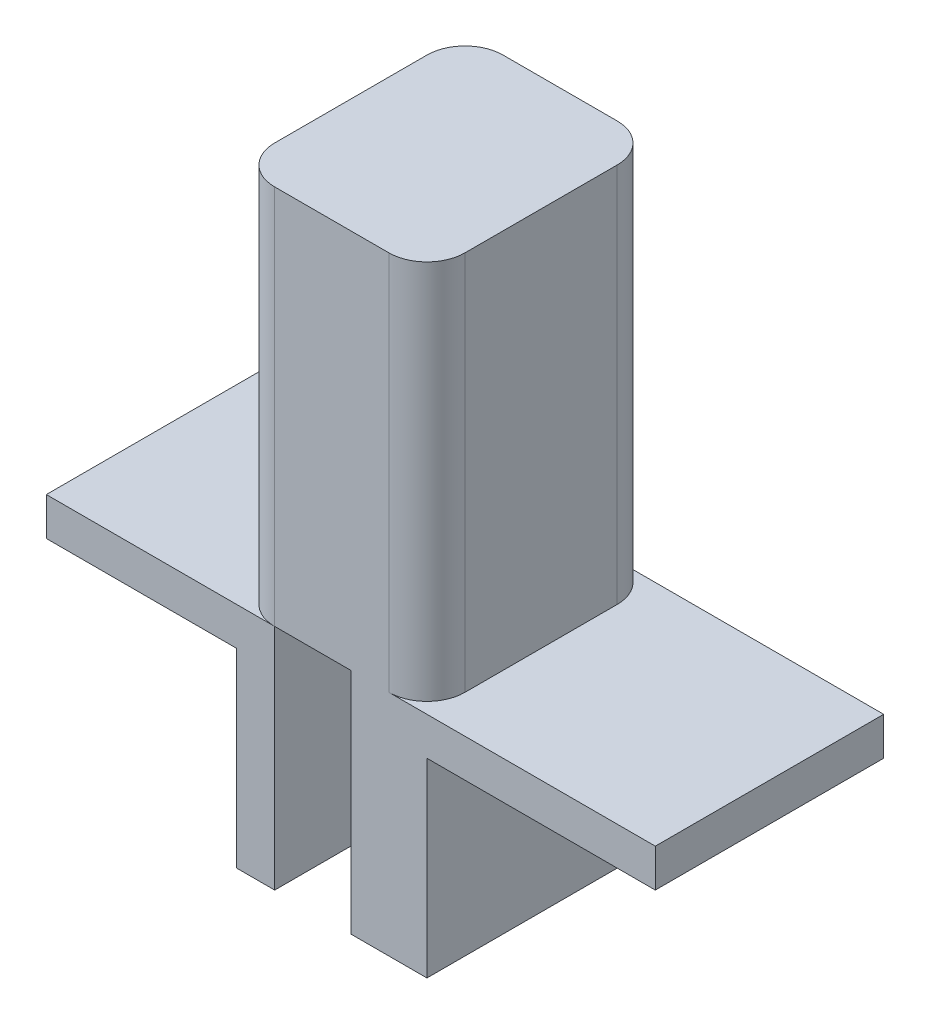
ISO-10303-21;
HEADER;
FILE_DESCRIPTION(('STEP AP214'),'2;1');
FILE_NAME('part.step','',(''),(''),'','','');
FILE_SCHEMA(('AUTOMOTIVE_DESIGN { 1 0 10303 214 1 1 1 1 }'));
ENDSEC;
DATA;
#1=APPLICATION_CONTEXT('core data for automotive mechanical design processes');
#2=APPLICATION_PROTOCOL_DEFINITION('international standard','automotive_design',2000,#1);
#3=PRODUCT_CONTEXT('',#1,'mechanical');
#4=PRODUCT('Part','Part','',(#3));
#5=PRODUCT_RELATED_PRODUCT_CATEGORY('part','',(#4));
#6=PRODUCT_DEFINITION_FORMATION('','',#4);
#7=PRODUCT_DEFINITION_CONTEXT('part definition',#1,'design');
#8=PRODUCT_DEFINITION('design','',#6,#7);
#9=PRODUCT_DEFINITION_SHAPE('','',#8);
#10=(LENGTH_UNIT() NAMED_UNIT(*) SI_UNIT(.MILLI.,.METRE.));
#11=(NAMED_UNIT(*) PLANE_ANGLE_UNIT() SI_UNIT($,.RADIAN.));
#12=(NAMED_UNIT(*) SI_UNIT($,.STERADIAN.) SOLID_ANGLE_UNIT());
#13=UNCERTAINTY_MEASURE_WITH_UNIT(LENGTH_MEASURE(1.E-05),#10,'distance_accuracy_value','');
#14=(GEOMETRIC_REPRESENTATION_CONTEXT(3) GLOBAL_UNCERTAINTY_ASSIGNED_CONTEXT((#13)) GLOBAL_UNIT_ASSIGNED_CONTEXT((#10,
#11,#12)) REPRESENTATION_CONTEXT('',''));
#15=CARTESIAN_POINT('',(0.,0.,0.));
#16=DIRECTION('',(0.,0.,1.));
#17=DIRECTION('',(1.,0.,0.));
#18=AXIS2_PLACEMENT_3D('',#15,#16,#17);
#19=CARTESIAN_POINT('',(-1.25,1.,1.5));
#20=DIRECTION('',(0.,0.,-1.));
#21=DIRECTION('',(-1.,0.,0.));
#22=AXIS2_PLACEMENT_3D('',#19,#20,#21);
#23=PLANE('',#22);
#24=DIRECTION('',(-1.,0.,0.));
#25=VECTOR('',#24,1.);
#26=CARTESIAN_POINT('',(4.25,0.,1.5));
#27=LINE('',#26,#25);
#28=CARTESIAN_POINT('',(4.25,0.,1.5));
#29=VERTEX_POINT('',#28);
#30=CARTESIAN_POINT('',(0.75,0.,1.5));
#31=VERTEX_POINT('',#30);
#32=EDGE_CURVE('E59',#29,#31,#27,.T.);
#33=ORIENTED_EDGE('',*,*,#32,.T.);
#34=DIRECTION('',(0.,-1.,0.));
#35=VECTOR('',#34,1.);
#36=CARTESIAN_POINT('',(0.75,1.,1.5));
#37=LINE('',#36,#35);
#38=CARTESIAN_POINT('',(0.75,5.,1.5));
#39=VERTEX_POINT('',#38);
#40=EDGE_CURVE('E349',#31,#39,#37,.F.);
#41=ORIENTED_EDGE('',*,*,#40,.T.);
#42=DIRECTION('',(1.,0.,0.));
#43=VECTOR('',#42,1.);
#44=CARTESIAN_POINT('',(-1.25,5.,1.5));
#45=LINE('',#44,#43);
#46=CARTESIAN_POINT('',(-0.75,5.,1.5));
#47=VERTEX_POINT('',#46);
#48=EDGE_CURVE('E367',#47,#39,#45,.T.);
#49=ORIENTED_EDGE('',*,*,#48,.F.);
#50=DIRECTION('',(0.,-1.,0.));
#51=VECTOR('',#50,1.);
#52=CARTESIAN_POINT('',(-0.75,1.,1.5));
#53=LINE('',#52,#51);
#54=CARTESIAN_POINT('',(-0.75,0.,1.5));
#55=VERTEX_POINT('',#54);
#56=EDGE_CURVE('E345',#47,#55,#53,.T.);
#57=ORIENTED_EDGE('',*,*,#56,.T.);
#58=DIRECTION('',(1.,0.,0.));
#59=VECTOR('',#58,1.);
#60=CARTESIAN_POINT('',(-1.25,0.,1.5));
#61=LINE('',#60,#59);
#62=CARTESIAN_POINT('',(0.25,0.,1.5));
#63=VERTEX_POINT('',#62);
#64=EDGE_CURVE('E299',#55,#63,#61,.T.);
#65=ORIENTED_EDGE('',*,*,#64,.T.);
#66=DIRECTION('',(0.,1.,0.));
#67=VECTOR('',#66,1.);
#68=CARTESIAN_POINT('',(0.25,-3.,1.5));
#69=LINE('',#68,#67);
#70=CARTESIAN_POINT('',(0.25,-3.,1.5));
#71=VERTEX_POINT('',#70);
#72=EDGE_CURVE('E291',#71,#63,#69,.T.);
#73=ORIENTED_EDGE('',*,*,#72,.F.);
#74=DIRECTION('',(-1.,0.,0.));
#75=VECTOR('',#74,1.);
#76=CARTESIAN_POINT('',(1.25,-3.,1.5));
#77=LINE('',#76,#75);
#78=CARTESIAN_POINT('',(1.25,-3.,1.5));
#79=VERTEX_POINT('',#78);
#80=EDGE_CURVE('E274',#79,#71,#77,.T.);
#81=ORIENTED_EDGE('',*,*,#80,.F.);
#82=DIRECTION('',(0.,-1.,0.));
#83=VECTOR('',#82,1.);
#84=CARTESIAN_POINT('',(1.25,1.,1.5));
#85=LINE('',#84,#83);
#86=CARTESIAN_POINT('',(1.25,-0.5,1.5));
#87=VERTEX_POINT('',#86);
#88=EDGE_CURVE('E302',#87,#79,#85,.T.);
#89=ORIENTED_EDGE('',*,*,#88,.F.);
#90=DIRECTION('',(-1.,0.,0.));
#91=VECTOR('',#90,1.);
#92=CARTESIAN_POINT('',(4.25,-0.5,1.5));
#93=LINE('',#92,#91);
#94=CARTESIAN_POINT('',(4.25,-0.5,1.5));
#95=VERTEX_POINT('',#94);
#96=EDGE_CURVE('E239',#95,#87,#93,.T.);
#97=ORIENTED_EDGE('',*,*,#96,.F.);
#98=DIRECTION('',(0.,-1.,0.));
#99=VECTOR('',#98,1.);
#100=CARTESIAN_POINT('',(4.25,0.,1.5));
#101=LINE('',#100,#99);
#102=EDGE_CURVE('E214',#29,#95,#101,.T.);
#103=ORIENTED_EDGE('',*,*,#102,.F.);
#104=EDGE_LOOP('',(#33,#41,#49,#57,#65,#73,#81,#89,#97,#103));
#105=FACE_BOUND('',#104,.T.);
#106=ADVANCED_FACE('F43',(#105),#23,.F.);
#107=CARTESIAN_POINT('',(-1.25,1.,-1.5));
#108=DIRECTION('',(0.,0.,1.));
#109=DIRECTION('',(1.,0.,0.));
#110=AXIS2_PLACEMENT_3D('',#107,#108,#109);
#111=PLANE('',#110);
#112=DIRECTION('',(1.,0.,0.));
#113=VECTOR('',#112,1.);
#114=CARTESIAN_POINT('',(-3.75,0.,-1.5));
#115=LINE('',#114,#113);
#116=CARTESIAN_POINT('',(-3.75,0.,-1.5));
#117=VERTEX_POINT('',#116);
#118=CARTESIAN_POINT('',(-0.75,0.,-1.5));
#119=VERTEX_POINT('',#118);
#120=EDGE_CURVE('E390',#117,#119,#115,.T.);
#121=ORIENTED_EDGE('',*,*,#120,.T.);
#122=DIRECTION('',(0.,1.,0.));
#123=VECTOR('',#122,1.);
#124=CARTESIAN_POINT('',(-0.75,-3.,-1.5));
#125=LINE('',#124,#123);
#126=CARTESIAN_POINT('',(-0.75,-3.,-1.5));
#127=VERTEX_POINT('',#126);
#128=EDGE_CURVE('E265',#127,#119,#125,.T.);
#129=ORIENTED_EDGE('',*,*,#128,.F.);
#130=DIRECTION('',(1.,0.,0.));
#131=VECTOR('',#130,1.);
#132=CARTESIAN_POINT('',(-1.25,-3.,-1.5));
#133=LINE('',#132,#131);
#134=CARTESIAN_POINT('',(-1.25,-3.,-1.5));
#135=VERTEX_POINT('',#134);
#136=EDGE_CURVE('E248',#135,#127,#133,.T.);
#137=ORIENTED_EDGE('',*,*,#136,.F.);
#138=DIRECTION('',(0.,-1.,0.));
#139=VECTOR('',#138,1.);
#140=CARTESIAN_POINT('',(-1.25,1.,-1.5));
#141=LINE('',#140,#139);
#142=CARTESIAN_POINT('',(-1.25,-0.5,-1.5));
#143=VERTEX_POINT('',#142);
#144=EDGE_CURVE('E201',#143,#135,#141,.T.);
#145=ORIENTED_EDGE('',*,*,#144,.F.);
#146=DIRECTION('',(1.,0.,0.));
#147=VECTOR('',#146,1.);
#148=CARTESIAN_POINT('',(-3.75,-0.5,-1.5));
#149=LINE('',#148,#147);
#150=CARTESIAN_POINT('',(-3.75,-0.5,-1.5));
#151=VERTEX_POINT('',#150);
#152=EDGE_CURVE('E180',#151,#143,#149,.T.);
#153=ORIENTED_EDGE('',*,*,#152,.F.);
#154=DIRECTION('',(0.,-1.,0.));
#155=VECTOR('',#154,1.);
#156=CARTESIAN_POINT('',(-3.75,0.,-1.5));
#157=LINE('',#156,#155);
#158=EDGE_CURVE('E187',#117,#151,#157,.T.);
#159=ORIENTED_EDGE('',*,*,#158,.F.);
#160=EDGE_LOOP('',(#121,#129,#137,#145,#153,#159));
#161=FACE_BOUND('',#160,.T.);
#162=ADVANCED_FACE('F199',(#161),#111,.F.);
#163=CARTESIAN_POINT('',(-1.25,1.,-1.5));
#164=DIRECTION('',(1.,0.,0.));
#165=DIRECTION('',(0.,0.,-1.));
#166=AXIS2_PLACEMENT_3D('',#163,#164,#165);
#167=PLANE('',#166);
#168=DIRECTION('',(0.,0.,1.));
#169=VECTOR('',#168,1.);
#170=CARTESIAN_POINT('',(-1.25,5.,-1.5));
#171=LINE('',#170,#169);
#172=CARTESIAN_POINT('',(-1.25,5.,-1.));
#173=VERTEX_POINT('',#172);
#174=CARTESIAN_POINT('',(-1.25,5.,1.));
#175=VERTEX_POINT('',#174);
#176=EDGE_CURVE('E378',#173,#175,#171,.T.);
#177=ORIENTED_EDGE('',*,*,#176,.F.);
#178=DIRECTION('',(0.,-1.,0.));
#179=VECTOR('',#178,1.);
#180=CARTESIAN_POINT('',(-1.25,1.,-1.));
#181=LINE('',#180,#179);
#182=CARTESIAN_POINT('',(-1.25,0.,-1.));
#183=VERTEX_POINT('',#182);
#184=EDGE_CURVE('E316',#173,#183,#181,.T.);
#185=ORIENTED_EDGE('',*,*,#184,.T.);
#186=DIRECTION('',(0.,0.,-1.));
#187=VECTOR('',#186,1.);
#188=CARTESIAN_POINT('',(-1.25,0.,-1.5));
#189=LINE('',#188,#187);
#190=CARTESIAN_POINT('',(-1.25,0.,1.));
#191=VERTEX_POINT('',#190);
#192=EDGE_CURVE('E196',#191,#183,#189,.T.);
#193=ORIENTED_EDGE('',*,*,#192,.F.);
#194=DIRECTION('',(0.,-1.,0.));
#195=VECTOR('',#194,1.);
#196=CARTESIAN_POINT('',(-1.25,1.,1.));
#197=LINE('',#196,#195);
#198=EDGE_CURVE('E313',#191,#175,#197,.F.);
#199=ORIENTED_EDGE('',*,*,#198,.T.);
#200=EDGE_LOOP('',(#177,#185,#193,#199));
#201=FACE_BOUND('',#200,.T.);
#202=ADVANCED_FACE('F462',(#201),#167,.F.);
#203=DIRECTION('',(0.,0.,1.));
#204=VECTOR('',#203,1.);
#205=CARTESIAN_POINT('',(-1.25,-0.5,-1.5));
#206=LINE('',#205,#204);
#207=CARTESIAN_POINT('',(-1.25,-0.5,1.5));
#208=VERTEX_POINT('',#207);
#209=EDGE_CURVE('E377',#143,#208,#206,.T.);
#210=ORIENTED_EDGE('',*,*,#209,.F.);
#211=ORIENTED_EDGE('',*,*,#144,.T.);
#212=DIRECTION('',(0.,0.,-1.));
#213=VECTOR('',#212,1.);
#214=CARTESIAN_POINT('',(-1.25,-3.,1.5));
#215=LINE('',#214,#213);
#216=CARTESIAN_POINT('',(-1.25,-3.,1.5));
#217=VERTEX_POINT('',#216);
#218=EDGE_CURVE('E244',#217,#135,#215,.T.);
#219=ORIENTED_EDGE('',*,*,#218,.F.);
#220=DIRECTION('',(0.,-1.,0.));
#221=VECTOR('',#220,1.);
#222=CARTESIAN_POINT('',(-1.25,1.,1.5));
#223=LINE('',#222,#221);
#224=EDGE_CURVE('E305',#208,#217,#223,.T.);
#225=ORIENTED_EDGE('',*,*,#224,.F.);
#226=EDGE_LOOP('',(#210,#211,#219,#225));
#227=FACE_BOUND('',#226,.T.);
#228=ADVANCED_FACE('F456',(#227),#167,.F.);
#229=CARTESIAN_POINT('',(1.25,1.,-1.5));
#230=DIRECTION('',(-1.,0.,0.));
#231=DIRECTION('',(0.,0.,1.));
#232=AXIS2_PLACEMENT_3D('',#229,#230,#231);
#233=PLANE('',#232);
#234=DIRECTION('',(0.,0.,1.));
#235=VECTOR('',#234,1.);
#236=CARTESIAN_POINT('',(1.25,0.,1.5));
#237=LINE('',#236,#235);
#238=CARTESIAN_POINT('',(1.25,0.,-1.));
#239=VERTEX_POINT('',#238);
#240=CARTESIAN_POINT('',(1.25,0.,1.));
#241=VERTEX_POINT('',#240);
#242=EDGE_CURVE('E208',#239,#241,#237,.T.);
#243=ORIENTED_EDGE('',*,*,#242,.F.);
#244=DIRECTION('',(0.,-1.,0.));
#245=VECTOR('',#244,1.);
#246=CARTESIAN_POINT('',(1.25,1.,-1.));
#247=LINE('',#246,#245);
#248=CARTESIAN_POINT('',(1.25,5.,-1.));
#249=VERTEX_POINT('',#248);
#250=EDGE_CURVE('E342',#239,#249,#247,.F.);
#251=ORIENTED_EDGE('',*,*,#250,.T.);
#252=DIRECTION('',(0.,0.,-1.));
#253=VECTOR('',#252,1.);
#254=CARTESIAN_POINT('',(1.25,5.,-1.5));
#255=LINE('',#254,#253);
#256=CARTESIAN_POINT('',(1.25,5.,1.));
#257=VERTEX_POINT('',#256);
#258=EDGE_CURVE('E450',#257,#249,#255,.T.);
#259=ORIENTED_EDGE('',*,*,#258,.F.);
#260=DIRECTION('',(0.,-1.,0.));
#261=VECTOR('',#260,1.);
#262=CARTESIAN_POINT('',(1.25,1.,1.));
#263=LINE('',#262,#261);
#264=EDGE_CURVE('E339',#257,#241,#263,.T.);
#265=ORIENTED_EDGE('',*,*,#264,.T.);
#266=EDGE_LOOP('',(#243,#251,#259,#265));
#267=FACE_BOUND('',#266,.T.);
#268=ADVANCED_FACE('F454',(#267),#233,.F.);
#269=DIRECTION('',(0.,0.,-1.));
#270=VECTOR('',#269,1.);
#271=CARTESIAN_POINT('',(1.25,-0.5,1.5));
#272=LINE('',#271,#270);
#273=CARTESIAN_POINT('',(1.25,-0.5,-1.5));
#274=VERTEX_POINT('',#273);
#275=EDGE_CURVE('E203',#87,#274,#272,.T.);
#276=ORIENTED_EDGE('',*,*,#275,.F.);
#277=ORIENTED_EDGE('',*,*,#88,.T.);
#278=DIRECTION('',(0.,0.,1.));
#279=VECTOR('',#278,1.);
#280=CARTESIAN_POINT('',(1.25,-3.,1.5));
#281=LINE('',#280,#279);
#282=CARTESIAN_POINT('',(1.25,-3.,-1.5));
#283=VERTEX_POINT('',#282);
#284=EDGE_CURVE('E270',#283,#79,#281,.T.);
#285=ORIENTED_EDGE('',*,*,#284,.F.);
#286=DIRECTION('',(0.,-1.,0.));
#287=VECTOR('',#286,1.);
#288=CARTESIAN_POINT('',(1.25,1.,-1.5));
#289=LINE('',#288,#287);
#290=EDGE_CURVE('E310',#274,#283,#289,.T.);
#291=ORIENTED_EDGE('',*,*,#290,.F.);
#292=EDGE_LOOP('',(#276,#277,#285,#291));
#293=FACE_BOUND('',#292,.T.);
#294=ADVANCED_FACE('F430',(#293),#233,.F.);
#295=CARTESIAN_POINT('',(0.,0.,0.));
#296=DIRECTION('',(0.,1.,0.));
#297=DIRECTION('',(0.,0.,1.));
#298=AXIS2_PLACEMENT_3D('',#295,#296,#297);
#299=PLANE('',#298);
#300=DIRECTION('',(0.,0.,1.));
#301=VECTOR('',#300,1.);
#302=CARTESIAN_POINT('',(-0.75,0.,1.5));
#303=LINE('',#302,#301);
#304=EDGE_CURVE('E243',#119,#55,#303,.T.);
#305=ORIENTED_EDGE('',*,*,#304,.F.);
#306=DIRECTION('',(-1.,0.,0.));
#307=VECTOR('',#306,1.);
#308=CARTESIAN_POINT('',(-1.25,0.,-1.5));
#309=LINE('',#308,#307);
#310=CARTESIAN_POINT('',(0.25,0.,-1.5));
#311=VERTEX_POINT('',#310);
#312=EDGE_CURVE('E295',#311,#119,#309,.T.);
#313=ORIENTED_EDGE('',*,*,#312,.F.);
#314=DIRECTION('',(0.,0.,-1.));
#315=VECTOR('',#314,1.);
#316=CARTESIAN_POINT('',(0.25,0.,1.5));
#317=LINE('',#316,#315);
#318=EDGE_CURVE('E269',#63,#311,#317,.T.);
#319=ORIENTED_EDGE('',*,*,#318,.F.);
#320=ORIENTED_EDGE('',*,*,#64,.F.);
#321=EDGE_LOOP('',(#305,#313,#319,#320));
#322=FACE_BOUND('',#321,.T.);
#323=ADVANCED_FACE('F417',(#322),#299,.F.);
#324=ORIENTED_EDGE('',*,*,#312,.T.);
#325=DIRECTION('',(0.,-1.,0.));
#326=VECTOR('',#325,1.);
#327=CARTESIAN_POINT('',(-0.75,1.,-1.5));
#328=LINE('',#327,#326);
#329=CARTESIAN_POINT('',(-0.75,5.,-1.5));
#330=VERTEX_POINT('',#329);
#331=EDGE_CURVE('E324',#119,#330,#328,.F.);
#332=ORIENTED_EDGE('',*,*,#331,.T.);
#333=DIRECTION('',(-1.,0.,0.));
#334=VECTOR('',#333,1.);
#335=CARTESIAN_POINT('',(-1.25,5.,-1.5));
#336=LINE('',#335,#334);
#337=CARTESIAN_POINT('',(0.75,5.,-1.5));
#338=VERTEX_POINT('',#337);
#339=EDGE_CURVE('E383',#338,#330,#336,.T.);
#340=ORIENTED_EDGE('',*,*,#339,.F.);
#341=DIRECTION('',(0.,-1.,0.));
#342=VECTOR('',#341,1.);
#343=CARTESIAN_POINT('',(0.75,1.,-1.5));
#344=LINE('',#343,#342);
#345=CARTESIAN_POINT('',(0.75,0.,-1.5));
#346=VERTEX_POINT('',#345);
#347=EDGE_CURVE('E320',#338,#346,#344,.T.);
#348=ORIENTED_EDGE('',*,*,#347,.T.);
#349=DIRECTION('',(-1.,0.,0.));
#350=VECTOR('',#349,1.);
#351=CARTESIAN_POINT('',(4.25,0.,-1.5));
#352=LINE('',#351,#350);
#353=CARTESIAN_POINT('',(4.25,0.,-1.5));
#354=VERTEX_POINT('',#353);
#355=EDGE_CURVE('E232',#354,#346,#352,.T.);
#356=ORIENTED_EDGE('',*,*,#355,.F.);
#357=DIRECTION('',(0.,1.,0.));
#358=VECTOR('',#357,1.);
#359=CARTESIAN_POINT('',(4.25,0.,-1.5));
#360=LINE('',#359,#358);
#361=CARTESIAN_POINT('',(4.25,-0.5,-1.5));
#362=VERTEX_POINT('',#361);
#363=EDGE_CURVE('E221',#362,#354,#360,.T.);
#364=ORIENTED_EDGE('',*,*,#363,.F.);
#365=DIRECTION('',(-1.,0.,0.));
#366=VECTOR('',#365,1.);
#367=CARTESIAN_POINT('',(4.25,-0.5,-1.5));
#368=LINE('',#367,#366);
#369=EDGE_CURVE('E235',#362,#274,#368,.T.);
#370=ORIENTED_EDGE('',*,*,#369,.T.);
#371=ORIENTED_EDGE('',*,*,#290,.T.);
#372=DIRECTION('',(1.,0.,0.));
#373=VECTOR('',#372,1.);
#374=CARTESIAN_POINT('',(1.25,-3.,-1.5));
#375=LINE('',#374,#373);
#376=CARTESIAN_POINT('',(0.25,-3.,-1.5));
#377=VERTEX_POINT('',#376);
#378=EDGE_CURVE('E280',#377,#283,#375,.T.);
#379=ORIENTED_EDGE('',*,*,#378,.F.);
#380=DIRECTION('',(0.,1.,0.));
#381=VECTOR('',#380,1.);
#382=CARTESIAN_POINT('',(0.25,-3.,-1.5));
#383=LINE('',#382,#381);
#384=EDGE_CURVE('E284',#377,#311,#383,.T.);
#385=ORIENTED_EDGE('',*,*,#384,.T.);
#386=EDGE_LOOP('',(#324,#332,#340,#348,#356,#364,#370,#371,#379,#385));
#387=FACE_BOUND('',#386,.T.);
#388=ADVANCED_FACE('F436',(#387),#111,.F.);
#389=DIRECTION('',(0.,1.,0.));
#390=VECTOR('',#389,1.);
#391=CARTESIAN_POINT('',(-0.75,-3.,1.5));
#392=LINE('',#391,#390);
#393=CARTESIAN_POINT('',(-0.75,-3.,1.5));
#394=VERTEX_POINT('',#393);
#395=EDGE_CURVE('E258',#394,#55,#392,.T.);
#396=ORIENTED_EDGE('',*,*,#395,.T.);
#397=DIRECTION('',(1.,0.,0.));
#398=VECTOR('',#397,1.);
#399=CARTESIAN_POINT('',(-3.75,0.,1.5));
#400=LINE('',#399,#398);
#401=CARTESIAN_POINT('',(-3.75,0.,1.5));
#402=VERTEX_POINT('',#401);
#403=EDGE_CURVE('E210',#402,#55,#400,.T.);
#404=ORIENTED_EDGE('',*,*,#403,.F.);
#405=DIRECTION('',(0.,1.,0.));
#406=VECTOR('',#405,1.);
#407=CARTESIAN_POINT('',(-3.75,0.,1.5));
#408=LINE('',#407,#406);
#409=CARTESIAN_POINT('',(-3.75,-0.5,1.5));
#410=VERTEX_POINT('',#409);
#411=EDGE_CURVE('E186',#410,#402,#408,.T.);
#412=ORIENTED_EDGE('',*,*,#411,.F.);
#413=DIRECTION('',(1.,0.,0.));
#414=VECTOR('',#413,1.);
#415=CARTESIAN_POINT('',(-3.75,-0.5,1.5));
#416=LINE('',#415,#414);
#417=EDGE_CURVE('E182',#410,#208,#416,.T.);
#418=ORIENTED_EDGE('',*,*,#417,.T.);
#419=ORIENTED_EDGE('',*,*,#224,.T.);
#420=DIRECTION('',(-1.,0.,0.));
#421=VECTOR('',#420,1.);
#422=CARTESIAN_POINT('',(-1.25,-3.,1.5));
#423=LINE('',#422,#421);
#424=EDGE_CURVE('E254',#394,#217,#423,.T.);
#425=ORIENTED_EDGE('',*,*,#424,.F.);
#426=EDGE_LOOP('',(#396,#404,#412,#418,#419,#425));
#427=FACE_BOUND('',#426,.T.);
#428=ADVANCED_FACE('F410',(#427),#23,.F.);
#429=CARTESIAN_POINT('',(0.25,-3.,1.5));
#430=DIRECTION('',(1.,0.,0.));
#431=DIRECTION('',(0.,0.,-1.));
#432=AXIS2_PLACEMENT_3D('',#429,#430,#431);
#433=PLANE('',#432);
#434=ORIENTED_EDGE('',*,*,#318,.T.);
#435=ORIENTED_EDGE('',*,*,#384,.F.);
#436=DIRECTION('',(0.,0.,-1.));
#437=VECTOR('',#436,1.);
#438=CARTESIAN_POINT('',(0.25,-3.,1.5));
#439=LINE('',#438,#437);
#440=EDGE_CURVE('E277',#71,#377,#439,.T.);
#441=ORIENTED_EDGE('',*,*,#440,.F.);
#442=ORIENTED_EDGE('',*,*,#72,.T.);
#443=EDGE_LOOP('',(#434,#435,#441,#442));
#444=FACE_BOUND('',#443,.T.);
#445=ADVANCED_FACE('F421',(#444),#433,.F.);
#446=CARTESIAN_POINT('',(0.,-3.,0.));
#447=DIRECTION('',(0.,1.,0.));
#448=DIRECTION('',(0.,0.,1.));
#449=AXIS2_PLACEMENT_3D('',#446,#447,#448);
#450=PLANE('',#449);
#451=ORIENTED_EDGE('',*,*,#284,.T.);
#452=ORIENTED_EDGE('',*,*,#80,.T.);
#453=ORIENTED_EDGE('',*,*,#440,.T.);
#454=ORIENTED_EDGE('',*,*,#378,.T.);
#455=EDGE_LOOP('',(#451,#452,#453,#454));
#456=FACE_BOUND('',#455,.T.);
#457=ADVANCED_FACE('F427',(#456),#450,.F.);
#458=CARTESIAN_POINT('',(-0.75,-3.,1.5));
#459=DIRECTION('',(-1.,0.,0.));
#460=DIRECTION('',(0.,0.,1.));
#461=AXIS2_PLACEMENT_3D('',#458,#459,#460);
#462=PLANE('',#461);
#463=ORIENTED_EDGE('',*,*,#304,.T.);
#464=ORIENTED_EDGE('',*,*,#395,.F.);
#465=DIRECTION('',(0.,0.,1.));
#466=VECTOR('',#465,1.);
#467=CARTESIAN_POINT('',(-0.75,-3.,1.5));
#468=LINE('',#467,#466);
#469=EDGE_CURVE('E251',#127,#394,#468,.T.);
#470=ORIENTED_EDGE('',*,*,#469,.F.);
#471=ORIENTED_EDGE('',*,*,#128,.T.);
#472=EDGE_LOOP('',(#463,#464,#470,#471));
#473=FACE_BOUND('',#472,.T.);
#474=ADVANCED_FACE('F414',(#473),#462,.F.);
#475=CARTESIAN_POINT('',(0.,-3.,0.));
#476=DIRECTION('',(0.,-1.,0.));
#477=DIRECTION('',(0.,0.,-1.));
#478=AXIS2_PLACEMENT_3D('',#475,#476,#477);
#479=PLANE('',#478);
#480=ORIENTED_EDGE('',*,*,#218,.T.);
#481=ORIENTED_EDGE('',*,*,#136,.T.);
#482=ORIENTED_EDGE('',*,*,#469,.T.);
#483=ORIENTED_EDGE('',*,*,#424,.T.);
#484=EDGE_LOOP('',(#480,#481,#482,#483));
#485=FACE_BOUND('',#484,.T.);
#486=ADVANCED_FACE('F491',(#485),#479,.T.);
#487=CARTESIAN_POINT('',(4.25,-0.5,1.5));
#488=DIRECTION('',(0.,1.,0.));
#489=DIRECTION('',(0.,0.,1.));
#490=AXIS2_PLACEMENT_3D('',#487,#488,#489);
#491=PLANE('',#490);
#492=ORIENTED_EDGE('',*,*,#275,.T.);
#493=ORIENTED_EDGE('',*,*,#369,.F.);
#494=DIRECTION('',(0.,0.,-1.));
#495=VECTOR('',#494,1.);
#496=CARTESIAN_POINT('',(4.25,-0.5,1.5));
#497=LINE('',#496,#495);
#498=EDGE_CURVE('E218',#95,#362,#497,.T.);
#499=ORIENTED_EDGE('',*,*,#498,.F.);
#500=ORIENTED_EDGE('',*,*,#96,.T.);
#501=EDGE_LOOP('',(#492,#493,#499,#500));
#502=FACE_BOUND('',#501,.T.);
#503=ADVANCED_FACE('F433',(#502),#491,.F.);
#504=CARTESIAN_POINT('',(4.25,0.,1.5));
#505=DIRECTION('',(0.,-1.,0.));
#506=DIRECTION('',(0.,0.,-1.));
#507=AXIS2_PLACEMENT_3D('',#504,#505,#506);
#508=PLANE('',#507);
#509=ORIENTED_EDGE('',*,*,#355,.T.);
#510=CARTESIAN_POINT('',(0.75,0.,-1.));
#511=DIRECTION('',(0.,-1.,0.));
#512=DIRECTION('',(0.,0.,-1.));
#513=AXIS2_PLACEMENT_3D('',#510,#511,#512);
#514=CIRCLE('',#513,0.5);
#515=EDGE_CURVE('E356',#346,#239,#514,.T.);
#516=ORIENTED_EDGE('',*,*,#515,.T.);
#517=ORIENTED_EDGE('',*,*,#242,.T.);
#518=CARTESIAN_POINT('',(0.75,0.,1.));
#519=DIRECTION('',(0.,-1.,0.));
#520=DIRECTION('',(0.,0.,-1.));
#521=AXIS2_PLACEMENT_3D('',#518,#519,#520);
#522=CIRCLE('',#521,0.5);
#523=EDGE_CURVE('E52',#241,#31,#522,.T.);
#524=ORIENTED_EDGE('',*,*,#523,.T.);
#525=ORIENTED_EDGE('',*,*,#32,.F.);
#526=DIRECTION('',(0.,0.,1.));
#527=VECTOR('',#526,1.);
#528=CARTESIAN_POINT('',(4.25,0.,1.5));
#529=LINE('',#528,#527);
#530=EDGE_CURVE('E224',#354,#29,#529,.T.);
#531=ORIENTED_EDGE('',*,*,#530,.F.);
#532=EDGE_LOOP('',(#509,#516,#517,#524,#525,#531));
#533=FACE_BOUND('',#532,.T.);
#534=ADVANCED_FACE('F360',(#533),#508,.F.);
#535=CARTESIAN_POINT('',(4.25,0.,0.));
#536=DIRECTION('',(1.,0.,0.));
#537=DIRECTION('',(0.,0.,-1.));
#538=AXIS2_PLACEMENT_3D('',#535,#536,#537);
#539=PLANE('',#538);
#540=ORIENTED_EDGE('',*,*,#102,.T.);
#541=ORIENTED_EDGE('',*,*,#498,.T.);
#542=ORIENTED_EDGE('',*,*,#363,.T.);
#543=ORIENTED_EDGE('',*,*,#530,.T.);
#544=EDGE_LOOP('',(#540,#541,#542,#543));
#545=FACE_BOUND('',#544,.T.);
#546=ADVANCED_FACE('F439',(#545),#539,.T.);
#547=CARTESIAN_POINT('',(-3.75,-0.5,-1.5));
#548=DIRECTION('',(0.,1.,0.));
#549=DIRECTION('',(0.,0.,1.));
#550=AXIS2_PLACEMENT_3D('',#547,#548,#549);
#551=PLANE('',#550);
#552=ORIENTED_EDGE('',*,*,#209,.T.);
#553=ORIENTED_EDGE('',*,*,#417,.F.);
#554=DIRECTION('',(0.,0.,1.));
#555=VECTOR('',#554,1.);
#556=CARTESIAN_POINT('',(-3.75,-0.5,-1.5));
#557=LINE('',#556,#555);
#558=EDGE_CURVE('E175',#151,#410,#557,.T.);
#559=ORIENTED_EDGE('',*,*,#558,.F.);
#560=ORIENTED_EDGE('',*,*,#152,.T.);
#561=EDGE_LOOP('',(#552,#553,#559,#560));
#562=FACE_BOUND('',#561,.T.);
#563=ADVANCED_FACE('F178',(#562),#551,.F.);
#564=CARTESIAN_POINT('',(-3.75,0.,-1.5));
#565=DIRECTION('',(0.,-1.,0.));
#566=DIRECTION('',(0.,0.,-1.));
#567=AXIS2_PLACEMENT_3D('',#564,#565,#566);
#568=PLANE('',#567);
#569=ORIENTED_EDGE('',*,*,#403,.T.);
#570=CARTESIAN_POINT('',(-0.75,0.,1.));
#571=DIRECTION('',(0.,-1.,0.));
#572=DIRECTION('',(0.,0.,-1.));
#573=AXIS2_PLACEMENT_3D('',#570,#571,#572);
#574=CIRCLE('',#573,0.5);
#575=EDGE_CURVE('E11',#55,#191,#574,.T.);
#576=ORIENTED_EDGE('',*,*,#575,.T.);
#577=ORIENTED_EDGE('',*,*,#192,.T.);
#578=CARTESIAN_POINT('',(-0.75,0.,-1.));
#579=DIRECTION('',(0.,-1.,0.));
#580=DIRECTION('',(0.,0.,-1.));
#581=AXIS2_PLACEMENT_3D('',#578,#579,#580);
#582=CIRCLE('',#581,0.5);
#583=EDGE_CURVE('E352',#183,#119,#582,.T.);
#584=ORIENTED_EDGE('',*,*,#583,.T.);
#585=ORIENTED_EDGE('',*,*,#120,.F.);
#586=DIRECTION('',(0.,0.,-1.));
#587=VECTOR('',#586,1.);
#588=CARTESIAN_POINT('',(-3.75,0.,-1.5));
#589=LINE('',#588,#587);
#590=EDGE_CURVE('E192',#402,#117,#589,.T.);
#591=ORIENTED_EDGE('',*,*,#590,.F.);
#592=EDGE_LOOP('',(#569,#576,#577,#584,#585,#591));
#593=FACE_BOUND('',#592,.T.);
#594=ADVANCED_FACE('F400',(#593),#568,.F.);
#595=CARTESIAN_POINT('',(-3.75,0.,0.));
#596=DIRECTION('',(-1.,0.,0.));
#597=DIRECTION('',(0.,0.,1.));
#598=AXIS2_PLACEMENT_3D('',#595,#596,#597);
#599=PLANE('',#598);
#600=ORIENTED_EDGE('',*,*,#158,.T.);
#601=ORIENTED_EDGE('',*,*,#558,.T.);
#602=ORIENTED_EDGE('',*,*,#411,.T.);
#603=ORIENTED_EDGE('',*,*,#590,.T.);
#604=EDGE_LOOP('',(#600,#601,#602,#603));
#605=FACE_BOUND('',#604,.T.);
#606=ADVANCED_FACE('F190',(#605),#599,.T.);
#607=CARTESIAN_POINT('',(0.,5.,0.));
#608=DIRECTION('',(0.,1.,0.));
#609=DIRECTION('',(0.,0.,1.));
#610=AXIS2_PLACEMENT_3D('',#607,#608,#609);
#611=PLANE('',#610);
#612=ORIENTED_EDGE('',*,*,#339,.T.);
#613=CARTESIAN_POINT('',(-0.75,5.,-1.));
#614=DIRECTION('',(0.,1.,0.));
#615=DIRECTION('',(0.,0.,1.));
#616=AXIS2_PLACEMENT_3D('',#613,#614,#615);
#617=CIRCLE('',#616,0.5);
#618=EDGE_CURVE('E336',#330,#173,#617,.T.);
#619=ORIENTED_EDGE('',*,*,#618,.T.);
#620=ORIENTED_EDGE('',*,*,#176,.T.);
#621=CARTESIAN_POINT('',(-0.75,5.,1.));
#622=DIRECTION('',(0.,1.,0.));
#623=DIRECTION('',(0.,0.,1.));
#624=AXIS2_PLACEMENT_3D('',#621,#622,#623);
#625=CIRCLE('',#624,0.5);
#626=EDGE_CURVE('E327',#175,#47,#625,.T.);
#627=ORIENTED_EDGE('',*,*,#626,.T.);
#628=ORIENTED_EDGE('',*,*,#48,.T.);
#629=CARTESIAN_POINT('',(0.75,5.,1.));
#630=DIRECTION('',(0.,1.,0.));
#631=DIRECTION('',(0.,0.,1.));
#632=AXIS2_PLACEMENT_3D('',#629,#630,#631);
#633=CIRCLE('',#632,0.5);
#634=EDGE_CURVE('E330',#39,#257,#633,.T.);
#635=ORIENTED_EDGE('',*,*,#634,.T.);
#636=ORIENTED_EDGE('',*,*,#258,.T.);
#637=CARTESIAN_POINT('',(0.75,5.,-1.));
#638=DIRECTION('',(0.,1.,0.));
#639=DIRECTION('',(0.,0.,1.));
#640=AXIS2_PLACEMENT_3D('',#637,#638,#639);
#641=CIRCLE('',#640,0.5);
#642=EDGE_CURVE('E333',#249,#338,#641,.T.);
#643=ORIENTED_EDGE('',*,*,#642,.T.);
#644=EDGE_LOOP('',(#612,#619,#620,#627,#628,#635,#636,#643));
#645=FACE_BOUND('',#644,.T.);
#646=ADVANCED_FACE('F371',(#645),#611,.T.);
#647=CARTESIAN_POINT('',(-0.75,1.,-1.));
#648=DIRECTION('',(0.,-1.,0.));
#649=DIRECTION('',(0.,0.,-1.));
#650=AXIS2_PLACEMENT_3D('',#647,#648,#649);
#651=CYLINDRICAL_SURFACE('',#650,0.5);
#652=ORIENTED_EDGE('',*,*,#618,.F.);
#653=ORIENTED_EDGE('',*,*,#331,.F.);
#654=ORIENTED_EDGE('',*,*,#583,.F.);
#655=ORIENTED_EDGE('',*,*,#184,.F.);
#656=EDGE_LOOP('',(#652,#653,#654,#655));
#657=FACE_BOUND('',#656,.T.);
#658=ADVANCED_FACE('F489',(#657),#651,.T.);
#659=CARTESIAN_POINT('',(0.75,1.,-1.));
#660=DIRECTION('',(0.,-1.,0.));
#661=DIRECTION('',(0.,0.,-1.));
#662=AXIS2_PLACEMENT_3D('',#659,#660,#661);
#663=CYLINDRICAL_SURFACE('',#662,0.5);
#664=ORIENTED_EDGE('',*,*,#642,.F.);
#665=ORIENTED_EDGE('',*,*,#250,.F.);
#666=ORIENTED_EDGE('',*,*,#515,.F.);
#667=ORIENTED_EDGE('',*,*,#347,.F.);
#668=EDGE_LOOP('',(#664,#665,#666,#667));
#669=FACE_BOUND('',#668,.T.);
#670=ADVANCED_FACE('F445',(#669),#663,.T.);
#671=CARTESIAN_POINT('',(0.75,1.,1.));
#672=DIRECTION('',(0.,-1.,0.));
#673=DIRECTION('',(0.,0.,-1.));
#674=AXIS2_PLACEMENT_3D('',#671,#672,#673);
#675=CYLINDRICAL_SURFACE('',#674,0.5);
#676=ORIENTED_EDGE('',*,*,#634,.F.);
#677=ORIENTED_EDGE('',*,*,#40,.F.);
#678=ORIENTED_EDGE('',*,*,#523,.F.);
#679=ORIENTED_EDGE('',*,*,#264,.F.);
#680=EDGE_LOOP('',(#676,#677,#678,#679));
#681=FACE_BOUND('',#680,.T.);
#682=ADVANCED_FACE('F364',(#681),#675,.T.);
#683=CARTESIAN_POINT('',(-0.75,1.,1.));
#684=DIRECTION('',(0.,-1.,0.));
#685=DIRECTION('',(0.,0.,-1.));
#686=AXIS2_PLACEMENT_3D('',#683,#684,#685);
#687=CYLINDRICAL_SURFACE('',#686,0.5);
#688=ORIENTED_EDGE('',*,*,#626,.F.);
#689=ORIENTED_EDGE('',*,*,#198,.F.);
#690=ORIENTED_EDGE('',*,*,#575,.F.);
#691=ORIENTED_EDGE('',*,*,#56,.F.);
#692=EDGE_LOOP('',(#688,#689,#690,#691));
#693=FACE_BOUND('',#692,.T.);
#694=ADVANCED_FACE('F45',(#693),#687,.T.);
#695=CLOSED_SHELL('',(#106,#162,#202,#228,#268,#294,#323,#388,#428,#445,#457,#474,#486,#503,
#534,#546,#563,#594,#606,#646,#658,#670,#682,#694));
#696=MANIFOLD_SOLID_BREP('B2',#695);
#697=ADVANCED_BREP_SHAPE_REPRESENTATION('',(#18,#696),#14);
#698=SHAPE_DEFINITION_REPRESENTATION(#9,#697);
ENDSEC;
END-ISO-10303-21;
